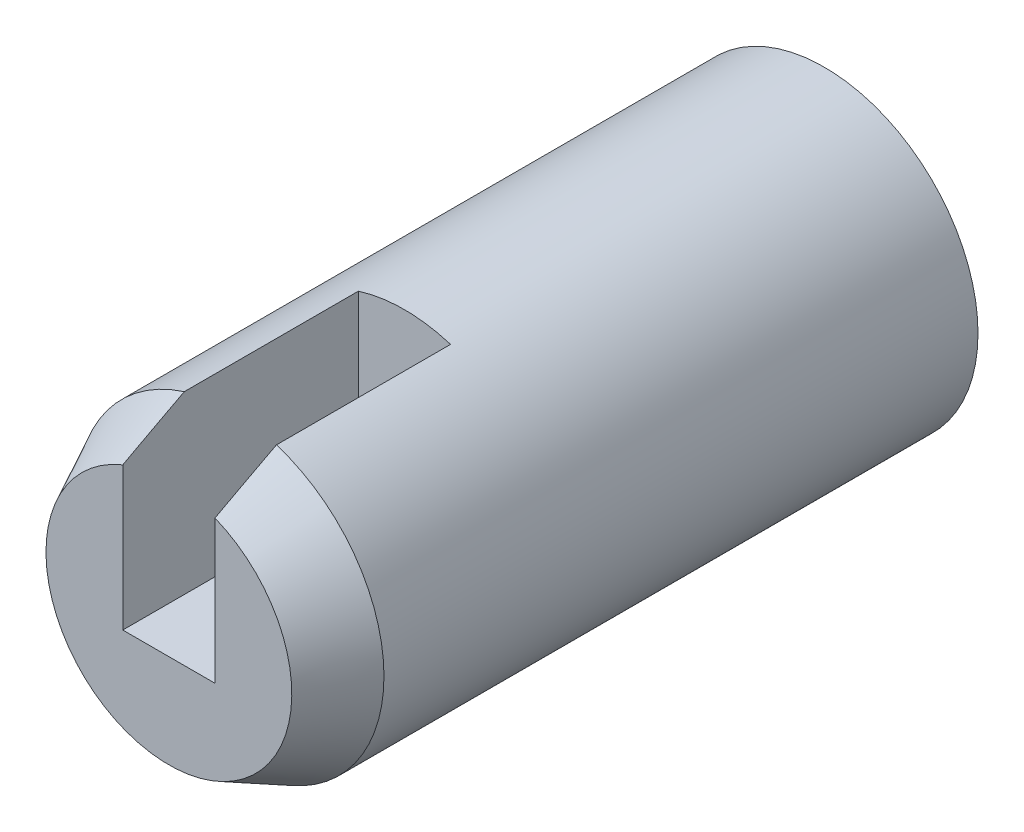
ISO-10303-21;
HEADER;
FILE_DESCRIPTION(('STEP AP214'),'2;1');
FILE_NAME('part.step','',(''),(''),'','','');
FILE_SCHEMA(('AUTOMOTIVE_DESIGN { 1 0 10303 214 1 1 1 1 }'));
ENDSEC;
DATA;
#1=APPLICATION_CONTEXT('core data for automotive mechanical design processes');
#2=APPLICATION_PROTOCOL_DEFINITION('international standard','automotive_design',2000,#1);
#3=PRODUCT_CONTEXT('',#1,'mechanical');
#4=PRODUCT('Part','Part','',(#3));
#5=PRODUCT_RELATED_PRODUCT_CATEGORY('part','',(#4));
#6=PRODUCT_DEFINITION_FORMATION('','',#4);
#7=PRODUCT_DEFINITION_CONTEXT('part definition',#1,'design');
#8=PRODUCT_DEFINITION('design','',#6,#7);
#9=PRODUCT_DEFINITION_SHAPE('','',#8);
#10=(LENGTH_UNIT() NAMED_UNIT(*) SI_UNIT(.MILLI.,.METRE.));
#11=(NAMED_UNIT(*) PLANE_ANGLE_UNIT() SI_UNIT($,.RADIAN.));
#12=(NAMED_UNIT(*) SI_UNIT($,.STERADIAN.) SOLID_ANGLE_UNIT());
#13=UNCERTAINTY_MEASURE_WITH_UNIT(LENGTH_MEASURE(1.E-05),#10,'distance_accuracy_value','');
#14=(GEOMETRIC_REPRESENTATION_CONTEXT(3) GLOBAL_UNCERTAINTY_ASSIGNED_CONTEXT((#13)) GLOBAL_UNIT_ASSIGNED_CONTEXT((#10,
#11,#12)) REPRESENTATION_CONTEXT('',''));
#15=CARTESIAN_POINT('',(0.,0.,0.));
#16=DIRECTION('',(0.,0.,1.));
#17=DIRECTION('',(1.,0.,0.));
#18=AXIS2_PLACEMENT_3D('',#15,#16,#17);
#19=CARTESIAN_POINT('',(-15.7705695568472,6.52979724470124,29.));
#20=DIRECTION('',(0.,0.,-1.));
#21=DIRECTION('',(-1.,0.,0.));
#22=AXIS2_PLACEMENT_3D('',#19,#20,#21);
#23=CYLINDRICAL_SURFACE('',#22,7.5);
#24=CARTESIAN_POINT('',(-15.7705695568472,6.52979724470124,29.));
#25=DIRECTION('',(0.,0.,-1.));
#26=DIRECTION('',(-1.,0.,0.));
#27=AXIS2_PLACEMENT_3D('',#24,#25,#26);
#28=CIRCLE('',#27,7.5);
#29=CARTESIAN_POINT('',(-18.0205695568472,13.6843412553283,29.));
#30=VERTEX_POINT('',#29);
#31=CARTESIAN_POINT('',(-13.5205695568472,13.6843412553283,29.));
#32=VERTEX_POINT('',#31);
#33=EDGE_CURVE('E204',#30,#32,#28,.F.);
#34=ORIENTED_EDGE('',*,*,#33,.F.);
#35=DIRECTION('',(0.,0.,-1.));
#36=VECTOR('',#35,1.);
#37=CARTESIAN_POINT('',(-18.0205695568472,13.6843412553283,29.));
#38=LINE('',#37,#36);
#39=CARTESIAN_POINT('',(-18.0205695568472,13.6843412553283,20.5));
#40=VERTEX_POINT('',#39);
#41=EDGE_CURVE('E68',#30,#40,#38,.T.);
#42=ORIENTED_EDGE('',*,*,#41,.T.);
#43=CARTESIAN_POINT('',(-15.7705695568472,6.52979724470124,20.5));
#44=DIRECTION('',(0.,0.,-1.));
#45=DIRECTION('',(-1.,0.,0.));
#46=AXIS2_PLACEMENT_3D('',#43,#44,#45);
#47=CIRCLE('',#46,7.5);
#48=CARTESIAN_POINT('',(-13.5205695568472,13.6843412553283,20.5));
#49=VERTEX_POINT('',#48);
#50=EDGE_CURVE('E12',#40,#49,#47,.T.);
#51=ORIENTED_EDGE('',*,*,#50,.T.);
#52=DIRECTION('',(0.,0.,-1.));
#53=VECTOR('',#52,1.);
#54=CARTESIAN_POINT('',(-13.5205695568472,13.6843412553283,29.));
#55=LINE('',#54,#53);
#56=EDGE_CURVE('E110',#49,#32,#55,.F.);
#57=ORIENTED_EDGE('',*,*,#56,.T.);
#58=EDGE_LOOP('',(#34,#42,#51,#57));
#59=FACE_BOUND('',#58,.T.);
#60=CARTESIAN_POINT('',(-15.7705695568472,6.52979724470124,0.));
#61=DIRECTION('',(0.,0.,1.));
#62=DIRECTION('',(1.,0.,0.));
#63=AXIS2_PLACEMENT_3D('',#60,#61,#62);
#64=CIRCLE('',#63,7.5);
#65=CARTESIAN_POINT('',(-8.27056955684718,6.52979724470124,0.));
#66=VERTEX_POINT('',#65);
#67=EDGE_CURVE('E207',#66,#66,#64,.T.);
#68=ORIENTED_EDGE('',*,*,#67,.T.);
#69=EDGE_LOOP('',(#68));
#70=FACE_BOUND('',#69,.T.);
#71=ADVANCED_FACE('F43',(#59,#70),#23,.T.);
#72=CARTESIAN_POINT('',(-15.7705695568472,6.52979724470124,0.));
#73=DIRECTION('',(0.,0.,1.));
#74=DIRECTION('',(1.,0.,0.));
#75=AXIS2_PLACEMENT_3D('',#72,#73,#74);
#76=PLANE('',#75);
#77=CARTESIAN_POINT('',(-15.7705695568472,6.52979724470124,0.));
#78=DIRECTION('',(0.,0.,-1.));
#79=DIRECTION('',(-1.,0.,0.));
#80=AXIS2_PLACEMENT_3D('',#77,#78,#79);
#81=CIRCLE('',#80,6.);
#82=CARTESIAN_POINT('',(-21.7705695568472,6.52979724470124,0.));
#83=VERTEX_POINT('',#82);
#84=EDGE_CURVE('E136',#83,#83,#81,.T.);
#85=ORIENTED_EDGE('',*,*,#84,.F.);
#86=EDGE_LOOP('',(#85));
#87=FACE_BOUND('',#86,.T.);
#88=ORIENTED_EDGE('',*,*,#67,.F.);
#89=EDGE_LOOP('',(#88));
#90=FACE_BOUND('',#89,.T.);
#91=ADVANCED_FACE('F165',(#87,#90),#76,.F.);
#92=CARTESIAN_POINT('',(-15.7705695568472,6.52979724470124,32.));
#93=DIRECTION('',(0.,0.,1.));
#94=DIRECTION('',(1.,0.,0.));
#95=AXIS2_PLACEMENT_3D('',#92,#93,#94);
#96=PLANE('',#95);
#97=DIRECTION('',(0.,-1.,0.));
#98=VECTOR('',#97,1.);
#99=CARTESIAN_POINT('',(-18.0205695568472,5.10718596773234,32.));
#100=LINE('',#99,#98);
#101=CARTESIAN_POINT('',(-18.0205695568472,12.091946110023,32.));
#102=VERTEX_POINT('',#101);
#103=CARTESIAN_POINT('',(-18.0205695568472,5.10718596773234,32.));
#104=VERTEX_POINT('',#103);
#105=EDGE_CURVE('E118',#102,#104,#100,.T.);
#106=ORIENTED_EDGE('',*,*,#105,.F.);
#107=CARTESIAN_POINT('',(-15.7705695568472,6.52979724470124,32.));
#108=DIRECTION('',(0.,0.,1.));
#109=DIRECTION('',(1.,0.,0.));
#110=AXIS2_PLACEMENT_3D('',#107,#108,#109);
#111=CIRCLE('',#110,6.);
#112=CARTESIAN_POINT('',(-13.520568827219,12.0919479130454,32.));
#113=VERTEX_POINT('',#112);
#114=EDGE_CURVE('E46',#102,#113,#111,.T.);
#115=ORIENTED_EDGE('',*,*,#114,.T.);
#116=DIRECTION('',(0.,1.,0.));
#117=VECTOR('',#116,1.);
#118=CARTESIAN_POINT('',(-13.5205695568472,15.8961706824173,32.));
#119=LINE('',#118,#117);
#120=CARTESIAN_POINT('',(-13.5205695568472,5.10718596773234,32.));
#121=VERTEX_POINT('',#120);
#122=EDGE_CURVE('E60',#121,#113,#119,.T.);
#123=ORIENTED_EDGE('',*,*,#122,.F.);
#124=DIRECTION('',(1.,0.,0.));
#125=VECTOR('',#124,1.);
#126=CARTESIAN_POINT('',(-15.7705695568472,5.10718596773234,32.));
#127=LINE('',#126,#125);
#128=EDGE_CURVE('E101',#104,#121,#127,.T.);
#129=ORIENTED_EDGE('',*,*,#128,.F.);
#130=EDGE_LOOP('',(#106,#115,#123,#129));
#131=FACE_BOUND('',#130,.T.);
#132=ADVANCED_FACE('F161',(#131),#96,.T.);
#133=CARTESIAN_POINT('',(-15.7705695568472,6.52979724470124,32.));
#134=DIRECTION('',(0.,0.,-1.));
#135=DIRECTION('',(-1.,0.,0.));
#136=AXIS2_PLACEMENT_3D('',#133,#134,#135);
#137=CONICAL_SURFACE('',#136,6.,0.463647609000806);
#138=CARTESIAN_POINT('',(-18.0205695568472,18.5274655545674,19.5863525974863));
#139=CARTESIAN_POINT('',(-18.0205695568472,18.2219247555725,20.18693500149));
#140=CARTESIAN_POINT('',(-18.0205695568472,17.9160908918438,20.7873686920471));
#141=CARTESIAN_POINT('',(-18.0205695568472,17.3036154745563,21.9878346409473));
#142=CARTESIAN_POINT('',(-18.0205695568472,16.9969739096227,22.5878668934862));
#143=CARTESIAN_POINT('',(-18.0205695568472,16.3821203251319,23.7884826206586));
#144=CARTESIAN_POINT('',(-18.0205695568472,16.0739064769058,24.3890651591949));
#145=CARTESIAN_POINT('',(-18.0205695568472,15.4561219941154,25.5895234273841));
#146=CARTESIAN_POINT('',(-18.0205695568472,15.1465513757022,26.1893991653435));
#147=CARTESIAN_POINT('',(-18.0205695568472,14.4993055009114,27.4388653218156));
#148=CARTESIAN_POINT('',(-18.0205695568472,14.1614668546373,28.0883711482372));
#149=CARTESIAN_POINT('',(-18.0205695568472,13.4826134234193,29.3857561728647));
#150=CARTESIAN_POINT('',(-18.0205695568472,13.1415985200557,30.0336353092705));
#151=CARTESIAN_POINT('',(-18.0205695568472,12.6266393409974,31.0029725583122));
#152=CARTESIAN_POINT('',(-18.0205695568472,12.4545514319744,31.3254164402226));
#153=CARTESIAN_POINT('',(-18.0205695568472,12.1087793076106,31.9694466272753));
#154=CARTESIAN_POINT('',(-18.0205695568472,11.9350950984695,32.2910329357418));
#155=CARTESIAN_POINT('',(-18.0205695568472,11.5856491309001,32.9330452271993));
#156=CARTESIAN_POINT('',(-18.0205695568472,11.4098875266193,33.2534712940064));
#157=CARTESIAN_POINT('',(-18.0205695568472,11.0555506959108,33.8927620123881));
#158=CARTESIAN_POINT('',(-18.0205695568472,10.8769755174836,34.2116266904791));
#159=CARTESIAN_POINT('',(-18.0205695568472,10.5890935250094,34.7182316769231));
#160=CARTESIAN_POINT('',(-18.0205695568472,10.4810686241807,34.906699983815));
#161=CARTESIAN_POINT('',(-18.0205695568472,10.2632494326273,35.2826317185488));
#162=CARTESIAN_POINT('',(-18.0205695568472,10.1534550131836,35.4700950719539));
#163=CARTESIAN_POINT('',(-18.0205695568472,9.93126735067891,35.8442917720685));
#164=CARTESIAN_POINT('',(-18.0205695568472,9.81886690147579,36.0310208486615));
#165=CARTESIAN_POINT('',(-18.0205695568472,9.59113975188111,36.4026392290826));
#166=CARTESIAN_POINT('',(-18.0205695568472,9.47581367812715,36.5875289152726));
#167=CARTESIAN_POINT('',(-18.0205695568472,9.24329139836589,36.951481015434));
#168=CARTESIAN_POINT('',(-18.0205695568472,9.12616588274194,37.1305884619827));
#169=CARTESIAN_POINT('',(-18.0205695568472,8.88649678123054,37.4854085173184));
#170=CARTESIAN_POINT('',(-18.0205695568472,8.76394868872957,37.6611181210971));
#171=CARTESIAN_POINT('',(-18.0205695568472,8.57459230484837,37.9199973723684));
#172=CARTESIAN_POINT('',(-18.0205695568472,8.51071391724332,38.0053068144997));
#173=CARTESIAN_POINT('',(-18.0205695568472,8.38056052926564,38.1740720016838));
#174=CARTESIAN_POINT('',(-18.0205695568472,8.314285813898,38.2575279652848));
#175=CARTESIAN_POINT('',(-18.0205695568472,8.17883209157172,38.4218566727886));
#176=CARTESIAN_POINT('',(-18.0205695568472,8.10965744053339,38.5027329909422));
#177=CARTESIAN_POINT('',(-18.0205695568472,7.96752026094352,38.6610668571489));
#178=CARTESIAN_POINT('',(-18.0205695568472,7.89455951390026,38.7385259819454));
#179=CARTESIAN_POINT('',(-18.0205695568472,7.77737907824479,38.8550387019158));
#180=CARTESIAN_POINT('',(-18.0205695568472,7.73486404214007,38.895804769762));
#181=CARTESIAN_POINT('',(-18.0205695568472,7.64806280796119,38.9754493540696));
#182=CARTESIAN_POINT('',(-18.0205695568472,7.60377597549267,39.0143271832114));
#183=CARTESIAN_POINT('',(-18.0205695568472,7.51323566574184,39.0896200007163));
#184=CARTESIAN_POINT('',(-18.0205695568472,7.46698480444353,39.1260381074805));
#185=CARTESIAN_POINT('',(-18.0205695568472,7.37220075217129,39.1957504140919));
#186=CARTESIAN_POINT('',(-18.0205695568472,7.32366837084219,39.2290457097568));
#187=CARTESIAN_POINT('',(-18.0205695568472,7.20492684039141,39.3036149090508));
#188=CARTESIAN_POINT('',(-18.0205695568472,7.1335355219594,39.3430595864347));
#189=CARTESIAN_POINT('',(-18.0205695568472,6.98559805489424,39.4108335678351));
#190=CARTESIAN_POINT('',(-18.0205695568472,6.909060793746,39.4391814870244));
#191=CARTESIAN_POINT('',(-18.0205695568472,6.76724471051637,39.4767449631211));
#192=CARTESIAN_POINT('',(-18.0205695568472,6.7026856900499,39.4886155116224));
#193=CARTESIAN_POINT('',(-18.0205695568472,6.57251218728954,39.5010604577109));
#194=CARTESIAN_POINT('',(-18.0205695568472,6.50689893836466,39.5016472125201));
#195=CARTESIAN_POINT('',(-18.0205695568472,6.37668041128503,39.4914706755161));
#196=CARTESIAN_POINT('',(-18.0205695568472,6.31207389990215,39.4807225966551));
#197=CARTESIAN_POINT('',(-18.0205695568472,6.18532917121339,39.4493139747432));
#198=CARTESIAN_POINT('',(-18.0205695568472,6.12319419418637,39.4286408551606));
#199=CARTESIAN_POINT('',(-18.0205695568472,5.9639255110769,39.3639088330273));
#200=CARTESIAN_POINT('',(-18.0205695568472,5.86946941580001,39.3133261110214));
#201=CARTESIAN_POINT('',(-18.0205695568472,5.73416576208137,39.2277090017162));
#202=CARTESIAN_POINT('',(-18.0205695568472,5.69003679110559,39.1974677809103));
#203=CARTESIAN_POINT('',(-18.0205695568472,5.60368257115655,39.1343752162033));
#204=CARTESIAN_POINT('',(-18.0205695568472,5.56145675343617,39.101524660304));
#205=CARTESIAN_POINT('',(-18.0205695568472,5.45473098890628,39.0141393021878));
#206=CARTESIAN_POINT('',(-18.0205695568472,5.3914991054527,38.958067679359));
#207=CARTESIAN_POINT('',(-18.0205695568472,5.26845242561927,38.8422683412276));
#208=CARTESIAN_POINT('',(-18.0205695568472,5.20863970611373,38.782538448491));
#209=CARTESIAN_POINT('',(-18.0205695568472,5.09169858735035,38.6602848929208));
#210=CARTESIAN_POINT('',(-18.0205695568472,5.03457603671545,38.5977556718528));
#211=CARTESIAN_POINT('',(-18.0205695568472,4.92262815973969,38.470670694448));
#212=CARTESIAN_POINT('',(-18.0205695568472,4.86780313620832,38.4061146729319));
#213=CARTESIAN_POINT('',(-18.0205695568472,4.75971097984344,38.2750204321558));
#214=CARTESIAN_POINT('',(-18.0205695568472,4.70645609190392,38.208472156348));
#215=CARTESIAN_POINT('',(-18.0205695568472,4.60155152312902,38.0741212919115));
#216=CARTESIAN_POINT('',(-18.0205695568472,4.54990191726811,38.0063186449328));
#217=CARTESIAN_POINT('',(-18.0205695568472,4.4480298586353,37.8698034282433));
#218=CARTESIAN_POINT('',(-18.0205695568472,4.39780546309717,37.8010923048943));
#219=CARTESIAN_POINT('',(-18.0205695568472,4.29851024122313,37.6628474285615));
#220=CARTESIAN_POINT('',(-18.0205695568472,4.24943937196134,37.5933137063341));
#221=CARTESIAN_POINT('',(-18.0205695568472,4.08519492679773,37.3570832235763));
#222=CARTESIAN_POINT('',(-18.0205695568472,3.97230585104301,37.1887975733557));
#223=CARTESIAN_POINT('',(-18.0205695568472,3.75049193776459,36.8496267264439));
#224=CARTESIAN_POINT('',(-18.0205695568472,3.64156760254578,36.6787412042293));
#225=CARTESIAN_POINT('',(-18.0205695568472,3.4266505350185,36.3350530600205));
#226=CARTESIAN_POINT('',(-18.0205695568472,3.32065889711074,36.1622497551879));
#227=CARTESIAN_POINT('',(-18.0205695568472,3.11096086599496,35.8152599301382));
#228=CARTESIAN_POINT('',(-18.0205695568472,3.0072545367807,35.6410733713722));
#229=CARTESIAN_POINT('',(-18.0205695568472,2.69846993225155,35.1163803817557));
#230=CARTESIAN_POINT('',(-18.0205695568472,2.49607023442258,34.7642991620512));
#231=CARTESIAN_POINT('',(-18.0205695568472,2.09595007435936,34.0576078752178));
#232=CARTESIAN_POINT('',(-18.0205695568472,1.89822858860504,33.7029983837474));
#233=CARTESIAN_POINT('',(-18.0205695568472,1.50680098100695,32.9934222324844));
#234=CARTESIAN_POINT('',(-18.0205695568472,1.31308195742006,32.638462680147));
#235=CARTESIAN_POINT('',(-18.0205695568472,0.927953312529682,31.9272697972241));
#236=CARTESIAN_POINT('',(-18.0205695568472,0.736543820787972,31.5710363966174));
#237=CARTESIAN_POINT('',(-18.0205695568472,0.355616997410865,30.8579277490927));
#238=CARTESIAN_POINT('',(-18.0205695568472,0.16609827013719,30.5010532470165));
#239=CARTESIAN_POINT('',(-18.0205695568472,-0.211601468178833,29.7865967698263));
#240=CARTESIAN_POINT('',(-18.0205695568472,-0.399782476604053,29.4290147933299));
#241=CARTESIAN_POINT('',(-18.0205695568472,-0.901015136329804,28.4731857345714));
#242=CARTESIAN_POINT('',(-18.0205695568472,-1.21312977924566,27.8744474432585));
#243=CARTESIAN_POINT('',(-18.0205695568472,-1.83540822067056,26.6757733455763));
#244=CARTESIAN_POINT('',(-18.0205695568472,-2.1455715229937,26.0758372819725));
#245=CARTESIAN_POINT('',(-18.0205695568472,-2.76485890860763,24.8743694356566));
#246=CARTESIAN_POINT('',(-18.0205695568472,-3.07398093722846,24.2728365944636));
#247=CARTESIAN_POINT('',(-18.0205695568472,-3.69101891868329,23.069345417875));
#248=CARTESIAN_POINT('',(-18.0205695568472,-3.99893515786316,22.4673872293256));
#249=CARTESIAN_POINT('',(-18.0205695568472,-4.30646143478141,21.8652307743078));
#250=B_SPLINE_CURVE_WITH_KNOTS('',3,(#138,#139,#140,#141,#142,#143,#144,#145,#146,#147,#148,
#149,#150,#151,#152,#153,#154,#155,#156,#157,#158,#159,#160,#161,#162,#163,#164,#165,#166,#167,
#168,#169,#170,#171,#172,#173,#174,#175,#176,#177,#178,#179,#180,#181,#182,#183,#184,#185,#186,
#187,#188,#189,#190,#191,#192,#193,#194,#195,#196,#197,#198,#199,#200,#201,#202,#203,#204,#205,
#206,#207,#208,#209,#210,#211,#212,#213,#214,#215,#216,#217,#218,#219,#220,#221,#222,#223,#224,
#225,#226,#227,#228,#229,#230,#231,#232,#233,#234,#235,#236,#237,#238,#239,#240,#241,#242,#243,
#244,#245,#246,#247,#248,#249),.UNSPECIFIED.,.F.,.F.,(4,2,2,2,2,2,2,2,2,2,2,2,2,2,2,2,2,2,2,2,2,
2,2,2,2,2,2,2,2,2,2,2,2,2,2,2,2,2,2,2,2,2,2,2,2,2,2,2,2,2,2,2,2,2,2,4),(0.,2.02150720647132,
4.04304303544003,6.06819769377115,8.09332830973241,10.2896694331276,12.486092772591,
13.5825651659169,14.6790333026875,15.7754205835361,16.8717891798486,17.5234776884302,
18.1752138183267,18.8290403872616,19.4827280766068,20.1246860791259,20.7671880088495,
21.0868804256822,21.4065349444638,21.7257254114182,22.0447670249473,22.2214274162286,
22.3981516372789,22.5746474327671,22.7510810610122,22.9950986283474,23.238705075831,
23.4347445489364,23.6305693210759,23.8261316027236,24.0219423481318,24.3414092046845,
24.5018593715802,24.6622612664876,24.9155898048686,25.1690706202136,25.4230792341669,
25.6771212213305,25.932792309631,26.1884753211241,26.443791195638,26.6990975540601,
27.3069315728115,27.9148423337239,28.5229769712794,29.1311286163814,30.3493996610306,
31.5674016550661,32.780529723352,33.9937255330818,35.2059474097048,36.4181716572808,
38.4437832237306,40.4698905781228,42.4988258136516,44.5272458041869),.UNSPECIFIED.);
#251=EDGE_CURVE('E53',#30,#102,#250,.T.);
#252=ORIENTED_EDGE('',*,*,#251,.F.);
#253=ORIENTED_EDGE('',*,*,#33,.T.);
#254=CARTESIAN_POINT('',(-13.5205695568472,-4.30646143478139,21.8652307743078));
#255=CARTESIAN_POINT('',(-13.5205695568472,-4.04275044135172,22.3816127635324));
#256=CARTESIAN_POINT('',(-13.5205695568472,-3.77874347646122,22.8978440105562));
#257=CARTESIAN_POINT('',(-13.5205695568472,-3.24992797977096,23.929911518538));
#258=CARTESIAN_POINT('',(-13.5205695568472,-2.9851194286986,24.4457477696194));
#259=CARTESIAN_POINT('',(-13.5205695568472,-2.45356633420988,25.478728736897));
#260=CARTESIAN_POINT('',(-13.5205695568472,-2.18681825623983,25.9958716351374));
#261=CARTESIAN_POINT('',(-13.5205695568472,-1.65201186853196,27.0294658539414));
#262=CARTESIAN_POINT('',(-13.5205695568472,-1.38395358701427,27.5459171890979));
#263=CARTESIAN_POINT('',(-13.5205695568472,-0.793706353050319,28.6783880147907));
#264=CARTESIAN_POINT('',(-13.5205695568472,-0.471141680357838,29.2942118136193));
#265=CARTESIAN_POINT('',(-13.5205695568472,0.177692957619228,30.5239668836748));
#266=CARTESIAN_POINT('',(-13.5205695568472,0.503963184737684,31.13789801722));
#267=CARTESIAN_POINT('',(-13.5205695568472,0.997200149091045,32.0553674618155));
#268=CARTESIAN_POINT('',(-13.5205695568472,1.16196055640917,32.3600911889117));
#269=CARTESIAN_POINT('',(-13.5205695568472,1.49339279024402,32.9684965255049));
#270=CARTESIAN_POINT('',(-13.5205695568472,1.66006460417376,33.2721781418472));
#271=CARTESIAN_POINT('',(-13.5205695568472,1.99592287441161,33.8780904628832));
#272=CARTESIAN_POINT('',(-13.5205695568472,2.16510895299248,34.1803213766734));
#273=CARTESIAN_POINT('',(-13.5205695568472,2.50695795596717,34.7828071469097));
#274=CARTESIAN_POINT('',(-13.5205695568472,2.67962077089936,35.0830620651744));
#275=CARTESIAN_POINT('',(-13.5205695568472,2.95558736683399,35.553762486927));
#276=CARTESIAN_POINT('',(-13.5205695568472,3.05721138278191,35.7251918324186));
#277=CARTESIAN_POINT('',(-13.5205695568472,3.26259222311584,36.0668124689794));
#278=CARTESIAN_POINT('',(-13.5205695568472,3.36634942279505,36.2370035349416));
#279=CARTESIAN_POINT('',(-13.5205695568472,3.57737263854557,36.5769640353321));
#280=CARTESIAN_POINT('',(-13.5205695568472,3.68465905474396,36.7467208550814));
#281=CARTESIAN_POINT('',(-13.5205695568472,3.90285043136161,37.0837746703582));
#282=CARTESIAN_POINT('',(-13.5205695568472,4.01375345870328,37.2510729128098));
#283=CARTESIAN_POINT('',(-13.5205695568472,4.23579470503578,37.5752354145896));
#284=CARTESIAN_POINT('',(-13.5205695568472,4.34672373976902,37.7322413768735));
#285=CARTESIAN_POINT('',(-13.5205695568472,4.51815790612884,37.9642933015778));
#286=CARTESIAN_POINT('',(-13.5205695568472,4.57620916222905,38.0411501465633));
#287=CARTESIAN_POINT('',(-13.5205695568472,4.69431838783424,38.1933021363999));
#288=CARTESIAN_POINT('',(-13.5205695568472,4.75437617367512,38.2685974231684));
#289=CARTESIAN_POINT('',(-13.5205695568472,4.87626418494786,38.4163283577958));
#290=CARTESIAN_POINT('',(-13.5205695568472,4.93806681905944,38.488786665779));
#291=CARTESIAN_POINT('',(-13.5205695568472,5.06464634403895,38.6310435860739));
#292=CARTESIAN_POINT('',(-13.5205695568472,5.12942239772511,38.7008429370231));
#293=CARTESIAN_POINT('',(-13.5205695568472,5.26249131066824,38.8365530397755));
#294=CARTESIAN_POINT('',(-13.5205695568472,5.33077109905325,38.9024765196893));
#295=CARTESIAN_POINT('',(-13.5205695568472,5.47198387966724,39.0290926995277));
#296=CARTESIAN_POINT('',(-13.5205695568472,5.54491124468625,39.0897915235683));
#297=CARTESIAN_POINT('',(-13.5205695568472,5.65352826647378,39.1711567291239));
#298=CARTESIAN_POINT('',(-13.5205695568472,5.68685218026371,39.1949858415101));
#299=CARTESIAN_POINT('',(-13.5205695568472,5.75470680732332,39.2409064881893));
#300=CARTESIAN_POINT('',(-13.5205695568472,5.78923810714278,39.2629971605192));
#301=CARTESIAN_POINT('',(-13.5205695568472,5.8595538293422,39.305064790513));
#302=CARTESIAN_POINT('',(-13.5205695568472,5.89533754342767,39.3250429180022));
#303=CARTESIAN_POINT('',(-13.5205695568472,5.96818677762387,39.362474310185));
#304=CARTESIAN_POINT('',(-13.5205695568472,6.00525230984257,39.3799275510205));
#305=CARTESIAN_POINT('',(-13.5205695568472,6.1197158157848,39.4283121078895));
#306=CARTESIAN_POINT('',(-13.5205695568472,6.19926434680518,39.4545666462507));
#307=CARTESIAN_POINT('',(-13.5205695568472,6.32122866986247,39.4814347276289));
#308=CARTESIAN_POINT('',(-13.5205695568472,6.36231462930836,39.4883050013934));
#309=CARTESIAN_POINT('',(-13.5205695568472,6.4449834304121,39.4975608773716));
#310=CARTESIAN_POINT('',(-13.5205695568472,6.48656611656649,39.4999478479073));
#311=CARTESIAN_POINT('',(-13.5205695568472,6.59889028254273,39.5000854760877));
#312=CARTESIAN_POINT('',(-13.5205695568472,6.66968067746637,39.4934247461108));
#313=CARTESIAN_POINT('',(-13.5205695568472,6.80888887782309,39.4676505377197));
#314=CARTESIAN_POINT('',(-13.5205695568472,6.87730398286054,39.4485233452826));
#315=CARTESIAN_POINT('',(-13.5205695568472,7.03694221280143,39.3907469735861));
#316=CARTESIAN_POINT('',(-13.5205695568472,7.12642322803425,39.3473602551859));
#317=CARTESIAN_POINT('',(-13.5205695568472,7.25494096934614,39.2727849862591));
#318=CARTESIAN_POINT('',(-13.5205695568472,7.29690510937905,39.2462835857037));
#319=CARTESIAN_POINT('',(-13.5205695568472,7.37909928649368,39.1907083140001));
#320=CARTESIAN_POINT('',(-13.5205695568472,7.41932968229513,39.1616349788343));
#321=CARTESIAN_POINT('',(-13.5205695568472,7.51684785253517,39.0872087108495));
#322=CARTESIAN_POINT('',(-13.5205695568472,7.57321239838743,39.0406550875858));
#323=CARTESIAN_POINT('',(-13.5205695568472,7.68307779805971,38.9442618816522));
#324=CARTESIAN_POINT('',(-13.5205695568472,7.73657705168862,38.8944204968209));
#325=CARTESIAN_POINT('',(-13.5205695568472,7.84126021574444,38.7921810952657));
#326=CARTESIAN_POINT('',(-13.5205695568472,7.89243948017502,38.7397783504311));
#327=CARTESIAN_POINT('',(-13.5205695568472,7.99277396069197,38.6330635234028));
#328=CARTESIAN_POINT('',(-13.5205695568472,8.04192879299947,38.578751082766));
#329=CARTESIAN_POINT('',(-13.5205695568472,8.18751058716738,38.4128414401716));
#330=CARTESIAN_POINT('',(-13.5205695568472,8.28135483116913,38.2989769748081));
#331=CARTESIAN_POINT('',(-13.5205695568472,8.41832688717907,38.1253694313109));
#332=CARTESIAN_POINT('',(-13.5205695568472,8.46332517586132,38.0670687260631));
#333=CARTESIAN_POINT('',(-13.5205695568472,8.55224506068943,37.9496522387239));
#334=CARTESIAN_POINT('',(-13.5205695568472,8.59616669671168,37.8905364869469));
#335=CARTESIAN_POINT('',(-13.5205695568472,8.73938398538185,37.6946187438265));
#336=CARTESIAN_POINT('',(-13.5205695568472,8.83671060819322,37.5563784076109));
#337=CARTESIAN_POINT('',(-13.5205695568472,9.0277865843096,37.2774391576255));
#338=CARTESIAN_POINT('',(-13.5205695568472,9.12153542992645,37.136739899033));
#339=CARTESIAN_POINT('',(-13.5205695568472,9.30633229259787,36.8534981465362));
#340=CARTESIAN_POINT('',(-13.5205695568472,9.39737914560836,36.7109548951305));
#341=CARTESIAN_POINT('',(-13.5205695568472,9.57732671357843,36.4245178650401));
#342=CARTESIAN_POINT('',(-13.5205695568472,9.66622735604201,36.2806240409623));
#343=CARTESIAN_POINT('',(-13.5205695568472,9.93069999693722,35.8468728353841));
#344=CARTESIAN_POINT('',(-13.5205695568472,10.1037140572186,35.5554572675365));
#345=CARTESIAN_POINT('',(-13.5205695568472,10.445158805051,34.9700710112229));
#346=CARTESIAN_POINT('',(-13.5205695568472,10.6135906384077,34.6761009862248));
#347=CARTESIAN_POINT('',(-13.5205695568472,10.9466601589416,34.0873548791768));
#348=CARTESIAN_POINT('',(-13.5205695568472,11.1113088940428,33.7925850371202));
#349=CARTESIAN_POINT('',(-13.5205695568472,11.4382653589205,33.2017285033502));
#350=CARTESIAN_POINT('',(-13.5205695568472,11.6005729402339,32.9056417296685));
#351=CARTESIAN_POINT('',(-13.5205695568472,11.9232428880935,32.3127930722355));
#352=CARTESIAN_POINT('',(-13.5205695568472,12.0836070296569,32.0160321535212));
#353=CARTESIAN_POINT('',(-13.5205695568472,12.4029490645659,31.4217650529348));
#354=CARTESIAN_POINT('',(-13.5205695568472,12.5619269539639,31.1242588689436));
#355=CARTESIAN_POINT('',(-13.5205695568472,12.9679621382165,30.3610433678692));
#356=CARTESIAN_POINT('',(-13.5205695568472,13.2142291521778,29.8949137732106));
#357=CARTESIAN_POINT('',(-13.5205695568472,13.7048420535675,28.96164134805));
#358=CARTESIAN_POINT('',(-13.5205695568472,13.9491879254173,28.4944985093707));
#359=CARTESIAN_POINT('',(-13.5205695568472,14.4365337609333,27.5592857611396));
#360=CARTESIAN_POINT('',(-13.5205695568472,14.6795331773639,27.0912155665669));
#361=CARTESIAN_POINT('',(-13.5205695568472,15.1644289838643,26.1545042283747));
#362=CARTESIAN_POINT('',(-13.5205695568472,15.4063253734278,25.6858630844933));
#363=CARTESIAN_POINT('',(-13.5205695568472,15.8891374596802,24.7483602434449));
#364=CARTESIAN_POINT('',(-13.5205695568472,16.130053570876,24.2794987596774));
#365=CARTESIAN_POINT('',(-13.5205695568472,16.6111954666477,23.3414212234863));
#366=CARTESIAN_POINT('',(-13.5205695568472,16.8514212505353,22.8722051707098));
#367=CARTESIAN_POINT('',(-13.5205695568472,17.3312132190392,21.9336832857642));
#368=CARTESIAN_POINT('',(-13.5205695568472,17.5707796373062,21.4643775730133));
#369=CARTESIAN_POINT('',(-13.5205695568472,18.049447571828,20.5255301117461));
#370=CARTESIAN_POINT('',(-13.5205695568472,18.288549088878,20.0559883636354));
#371=CARTESIAN_POINT('',(-13.5205695568472,18.5274655545674,19.5863525974863));
#372=B_SPLINE_CURVE_WITH_KNOTS('',3,(#254,#255,#256,#257,#258,#259,#260,#261,#262,#263,#264,
#265,#266,#267,#268,#269,#270,#271,#272,#273,#274,#275,#276,#277,#278,#279,#280,#281,#282,#283,
#284,#285,#286,#287,#288,#289,#290,#291,#292,#293,#294,#295,#296,#297,#298,#299,#300,#301,#302,
#303,#304,#305,#306,#307,#308,#309,#310,#311,#312,#313,#314,#315,#316,#317,#318,#319,#320,#321,
#322,#323,#324,#325,#326,#327,#328,#329,#330,#331,#332,#333,#334,#335,#336,#337,#338,#339,#340,
#341,#342,#343,#344,#345,#346,#347,#348,#349,#350,#351,#352,#353,#354,#355,#356,#357,#358,#359,
#360,#361,#362,#363,#364,#365,#366,#367,#368,#369,#370,#371),.UNSPECIFIED.,.F.,.F.,(4,2,2,2,2,2,
2,2,2,2,2,2,2,2,2,2,2,2,2,2,2,2,2,2,2,2,2,2,2,2,2,2,2,2,2,2,2,2,2,2,2,2,2,2,2,2,2,2,2,2,2,2,2,2,
2,2,2,2,4),(0.,1.73946721450233,3.47897658874311,5.22463317479911,6.97025232589053,
9.05581103944758,11.1415180466019,12.1807547265044,13.2199845667554,14.2590598271139,
15.2981024242034,15.8959531777868,16.493910027491,17.0963272117061,17.6984275180654,
18.2750090727966,18.5639341873034,18.8528329276338,19.1384769055343,19.4240409463596,
19.7086077757145,19.992836371994,20.115693930514,20.2386120260975,20.3614616951382,
20.484312524927,20.7339346806781,20.8586924058306,20.9834120482403,21.1953784202481,
21.4075783652721,21.7041162530643,21.852961466954,22.0017757347509,22.220912927085,
22.4401712523043,22.6598508420773,22.8795718873845,23.3219888131765,23.5429239699061,
23.7638509313747,24.2709566167805,24.7781339951564,25.2855267886735,25.7929366972989,
26.809580048309,27.8259668020394,28.8388613433196,29.8518198368258,30.8637703009871,
31.8757236458632,33.4572722942006,35.0388337540905,36.6209967307474,38.2031604335625,
39.7845657390389,41.3659726202949,42.946718778471,44.5274622305925),.UNSPECIFIED.);
#373=EDGE_CURVE('E178',#113,#32,#372,.T.);
#374=ORIENTED_EDGE('',*,*,#373,.F.);
#375=ORIENTED_EDGE('',*,*,#114,.F.);
#376=EDGE_LOOP('',(#252,#253,#374,#375));
#377=FACE_BOUND('',#376,.T.);
#378=ADVANCED_FACE('F152',(#377),#137,.T.);
#379=CARTESIAN_POINT('',(-15.7705695568472,6.52979724470124,8.));
#380=DIRECTION('',(0.,0.,-1.));
#381=DIRECTION('',(-1.,0.,0.));
#382=AXIS2_PLACEMENT_3D('',#379,#380,#381);
#383=CYLINDRICAL_SURFACE('',#382,6.);
#384=CARTESIAN_POINT('',(-15.7705695568472,6.52979724470124,8.));
#385=DIRECTION('',(0.,0.,-1.));
#386=DIRECTION('',(-1.,0.,0.));
#387=AXIS2_PLACEMENT_3D('',#384,#385,#386);
#388=CIRCLE('',#387,6.);
#389=CARTESIAN_POINT('',(-21.7705695568472,6.52979724470124,8.));
#390=VERTEX_POINT('',#389);
#391=EDGE_CURVE('E137',#390,#390,#388,.T.);
#392=ORIENTED_EDGE('',*,*,#391,.F.);
#393=EDGE_LOOP('',(#392));
#394=FACE_BOUND('',#393,.T.);
#395=ORIENTED_EDGE('',*,*,#84,.T.);
#396=EDGE_LOOP('',(#395));
#397=FACE_BOUND('',#396,.T.);
#398=ADVANCED_FACE('F160',(#394,#397),#383,.F.);
#399=CARTESIAN_POINT('',(-15.7705695568472,6.52979724470124,8.));
#400=DIRECTION('',(0.,0.,-1.));
#401=DIRECTION('',(-1.,0.,0.));
#402=AXIS2_PLACEMENT_3D('',#399,#400,#401);
#403=PLANE('',#402);
#404=ORIENTED_EDGE('',*,*,#391,.T.);
#405=EDGE_LOOP('',(#404));
#406=FACE_BOUND('',#405,.T.);
#407=ADVANCED_FACE('F186',(#406),#403,.T.);
#408=CARTESIAN_POINT('',(0.,0.,20.5));
#409=DIRECTION('',(0.,0.,-1.));
#410=DIRECTION('',(-1.,0.,0.));
#411=AXIS2_PLACEMENT_3D('',#408,#409,#410);
#412=PLANE('',#411);
#413=DIRECTION('',(0.,-1.,0.));
#414=VECTOR('',#413,1.);
#415=CARTESIAN_POINT('',(-18.0205695568472,5.10718596773234,20.5));
#416=LINE('',#415,#414);
#417=CARTESIAN_POINT('',(-18.0205695568472,5.10718596773234,20.5));
#418=VERTEX_POINT('',#417);
#419=EDGE_CURVE('E104',#40,#418,#416,.T.);
#420=ORIENTED_EDGE('',*,*,#419,.T.);
#421=DIRECTION('',(1.,0.,0.));
#422=VECTOR('',#421,1.);
#423=CARTESIAN_POINT('',(-13.5205695568472,5.10718596773234,20.5));
#424=LINE('',#423,#422);
#425=CARTESIAN_POINT('',(-13.5205695568472,5.10718596773234,20.5));
#426=VERTEX_POINT('',#425);
#427=EDGE_CURVE('E98',#418,#426,#424,.T.);
#428=ORIENTED_EDGE('',*,*,#427,.T.);
#429=DIRECTION('',(0.,1.,0.));
#430=VECTOR('',#429,1.);
#431=CARTESIAN_POINT('',(-13.5205695568472,15.8961706824173,20.5));
#432=LINE('',#431,#430);
#433=EDGE_CURVE('E107',#426,#49,#432,.T.);
#434=ORIENTED_EDGE('',*,*,#433,.T.);
#435=ORIENTED_EDGE('',*,*,#50,.F.);
#436=EDGE_LOOP('',(#420,#428,#434,#435));
#437=FACE_BOUND('',#436,.T.);
#438=ADVANCED_FACE('F114',(#437),#412,.F.);
#439=CARTESIAN_POINT('',(-18.0205695568472,5.10718596773234,20.5));
#440=DIRECTION('',(-1.,0.,0.));
#441=DIRECTION('',(0.,0.,1.));
#442=AXIS2_PLACEMENT_3D('',#439,#440,#441);
#443=PLANE('',#442);
#444=ORIENTED_EDGE('',*,*,#251,.T.);
#445=ORIENTED_EDGE('',*,*,#105,.T.);
#446=DIRECTION('',(0.,0.,1.));
#447=VECTOR('',#446,1.);
#448=CARTESIAN_POINT('',(-18.0205695568472,5.10718596773234,20.5));
#449=LINE('',#448,#447);
#450=EDGE_CURVE('E103',#418,#104,#449,.T.);
#451=ORIENTED_EDGE('',*,*,#450,.F.);
#452=ORIENTED_EDGE('',*,*,#419,.F.);
#453=ORIENTED_EDGE('',*,*,#41,.F.);
#454=EDGE_LOOP('',(#444,#445,#451,#452,#453));
#455=FACE_BOUND('',#454,.T.);
#456=ADVANCED_FACE('F183',(#455),#443,.F.);
#457=CARTESIAN_POINT('',(-13.5205695568472,15.8961706824173,20.5));
#458=DIRECTION('',(1.,0.,0.));
#459=DIRECTION('',(0.,1.,0.));
#460=AXIS2_PLACEMENT_3D('',#457,#458,#459);
#461=PLANE('',#460);
#462=ORIENTED_EDGE('',*,*,#433,.F.);
#463=DIRECTION('',(0.,0.,1.));
#464=VECTOR('',#463,1.);
#465=CARTESIAN_POINT('',(-13.5205695568472,5.10718596773234,20.5));
#466=LINE('',#465,#464);
#467=EDGE_CURVE('E93',#426,#121,#466,.T.);
#468=ORIENTED_EDGE('',*,*,#467,.T.);
#469=ORIENTED_EDGE('',*,*,#122,.T.);
#470=ORIENTED_EDGE('',*,*,#373,.T.);
#471=ORIENTED_EDGE('',*,*,#56,.F.);
#472=EDGE_LOOP('',(#462,#468,#469,#470,#471));
#473=FACE_BOUND('',#472,.T.);
#474=ADVANCED_FACE('F108',(#473),#461,.F.);
#475=CARTESIAN_POINT('',(-15.7705695568472,5.10718596773234,20.5));
#476=DIRECTION('',(0.,-1.,0.));
#477=DIRECTION('',(1.,0.,0.));
#478=AXIS2_PLACEMENT_3D('',#475,#476,#477);
#479=PLANE('',#478);
#480=ORIENTED_EDGE('',*,*,#128,.T.);
#481=ORIENTED_EDGE('',*,*,#467,.F.);
#482=ORIENTED_EDGE('',*,*,#427,.F.);
#483=ORIENTED_EDGE('',*,*,#450,.T.);
#484=EDGE_LOOP('',(#480,#481,#482,#483));
#485=FACE_BOUND('',#484,.T.);
#486=ADVANCED_FACE('F95',(#485),#479,.F.);
#487=CLOSED_SHELL('',(#71,#91,#132,#378,#398,#407,#438,#456,#474,#486));
#488=MANIFOLD_SOLID_BREP('B2',#487);
#489=ADVANCED_BREP_SHAPE_REPRESENTATION('',(#18,#488),#14);
#490=SHAPE_DEFINITION_REPRESENTATION(#9,#489);
ENDSEC;
END-ISO-10303-21;
